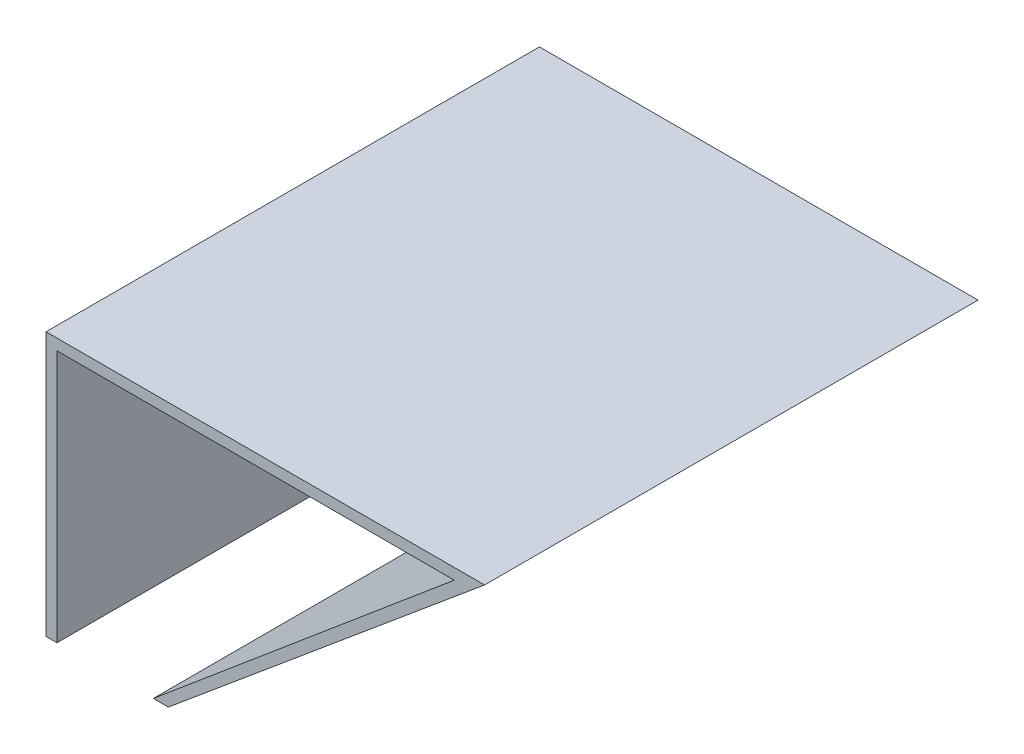
ISO-10303-21;
HEADER;
FILE_DESCRIPTION(('STEP AP214'),'2;1');
FILE_NAME('part.step','',(''),(''),'','','');
FILE_SCHEMA(('AUTOMOTIVE_DESIGN { 1 0 10303 214 1 1 1 1 }'));
ENDSEC;
DATA;
#1=APPLICATION_CONTEXT('core data for automotive mechanical design processes');
#2=APPLICATION_PROTOCOL_DEFINITION('international standard','automotive_design',2000,#1);
#3=PRODUCT_CONTEXT('',#1,'mechanical');
#4=PRODUCT('Part','Part','',(#3));
#5=PRODUCT_RELATED_PRODUCT_CATEGORY('part','',(#4));
#6=PRODUCT_DEFINITION_FORMATION('','',#4);
#7=PRODUCT_DEFINITION_CONTEXT('part definition',#1,'design');
#8=PRODUCT_DEFINITION('design','',#6,#7);
#9=PRODUCT_DEFINITION_SHAPE('','',#8);
#10=(LENGTH_UNIT() NAMED_UNIT(*) SI_UNIT(.MILLI.,.METRE.));
#11=(NAMED_UNIT(*) PLANE_ANGLE_UNIT() SI_UNIT($,.RADIAN.));
#12=(NAMED_UNIT(*) SI_UNIT($,.STERADIAN.) SOLID_ANGLE_UNIT());
#13=UNCERTAINTY_MEASURE_WITH_UNIT(LENGTH_MEASURE(1.E-05),#10,'distance_accuracy_value','');
#14=(GEOMETRIC_REPRESENTATION_CONTEXT(3) GLOBAL_UNCERTAINTY_ASSIGNED_CONTEXT((#13)) GLOBAL_UNIT_ASSIGNED_CONTEXT((#10,
#11,#12)) REPRESENTATION_CONTEXT('',''));
#15=CARTESIAN_POINT('',(0.,0.,0.));
#16=DIRECTION('',(0.,0.,1.));
#17=DIRECTION('',(1.,0.,0.));
#18=AXIS2_PLACEMENT_3D('',#15,#16,#17);
#19=CARTESIAN_POINT('',(0.,0.,45.));
#20=DIRECTION('',(0.,1.,0.));
#21=DIRECTION('',(0.,0.,1.));
#22=AXIS2_PLACEMENT_3D('',#19,#20,#21);
#23=PLANE('',#22);
#24=DIRECTION('',(1.,0.,0.));
#25=VECTOR('',#24,1.);
#26=CARTESIAN_POINT('',(0.,0.,0.));
#27=LINE('',#26,#25);
#28=CARTESIAN_POINT('',(0.,0.,0.));
#29=VERTEX_POINT('',#28);
#30=CARTESIAN_POINT('',(1.,0.,0.));
#31=VERTEX_POINT('',#30);
#32=EDGE_CURVE('E128',#29,#31,#27,.T.);
#33=ORIENTED_EDGE('',*,*,#32,.T.);
#34=DIRECTION('',(0.,0.,-1.));
#35=VECTOR('',#34,1.);
#36=CARTESIAN_POINT('',(1.,0.,45.));
#37=LINE('',#36,#35);
#38=CARTESIAN_POINT('',(1.,0.,45.));
#39=VERTEX_POINT('',#38);
#40=EDGE_CURVE('E11',#39,#31,#37,.T.);
#41=ORIENTED_EDGE('',*,*,#40,.F.);
#42=DIRECTION('',(1.,0.,0.));
#43=VECTOR('',#42,1.);
#44=CARTESIAN_POINT('',(0.,0.,45.));
#45=LINE('',#44,#43);
#46=CARTESIAN_POINT('',(0.,0.,45.));
#47=VERTEX_POINT('',#46);
#48=EDGE_CURVE('E142',#47,#39,#45,.T.);
#49=ORIENTED_EDGE('',*,*,#48,.F.);
#50=DIRECTION('',(0.,0.,-1.));
#51=VECTOR('',#50,1.);
#52=CARTESIAN_POINT('',(0.,0.,45.));
#53=LINE('',#52,#51);
#54=EDGE_CURVE('E124',#47,#29,#53,.T.);
#55=ORIENTED_EDGE('',*,*,#54,.T.);
#56=EDGE_LOOP('',(#33,#41,#49,#55));
#57=FACE_BOUND('',#56,.T.);
#58=ADVANCED_FACE('F32',(#57),#23,.F.);
#59=CARTESIAN_POINT('',(1.,23.0660171782963,45.));
#60=DIRECTION('',(-1.,0.,0.));
#61=DIRECTION('',(0.,-1.,0.));
#62=AXIS2_PLACEMENT_3D('',#59,#60,#61);
#63=PLANE('',#62);
#64=DIRECTION('',(0.,1.,0.));
#65=VECTOR('',#64,1.);
#66=CARTESIAN_POINT('',(1.,23.0660171782963,0.));
#67=LINE('',#66,#65);
#68=CARTESIAN_POINT('',(1.,23.0660171782963,0.));
#69=VERTEX_POINT('',#68);
#70=EDGE_CURVE('E131',#31,#69,#67,.T.);
#71=ORIENTED_EDGE('',*,*,#70,.T.);
#72=DIRECTION('',(0.,0.,-1.));
#73=VECTOR('',#72,1.);
#74=CARTESIAN_POINT('',(1.,23.0660171782963,45.));
#75=LINE('',#74,#73);
#76=CARTESIAN_POINT('',(1.,23.0660171782963,45.));
#77=VERTEX_POINT('',#76);
#78=EDGE_CURVE('E40',#77,#69,#75,.T.);
#79=ORIENTED_EDGE('',*,*,#78,.F.);
#80=DIRECTION('',(0.,1.,0.));
#81=VECTOR('',#80,1.);
#82=CARTESIAN_POINT('',(1.,23.0660171782963,45.));
#83=LINE('',#82,#81);
#84=EDGE_CURVE('E91',#39,#77,#83,.T.);
#85=ORIENTED_EDGE('',*,*,#84,.F.);
#86=ORIENTED_EDGE('',*,*,#40,.T.);
#87=EDGE_LOOP('',(#71,#79,#85,#86));
#88=FACE_BOUND('',#87,.T.);
#89=ADVANCED_FACE('F177',(#88),#63,.F.);
#90=CARTESIAN_POINT('',(37.2408481292946,23.0660171782963,45.));
#91=DIRECTION('',(0.,1.,0.));
#92=DIRECTION('',(-1.,0.,0.));
#93=AXIS2_PLACEMENT_3D('',#90,#91,#92);
#94=PLANE('',#93);
#95=DIRECTION('',(1.,0.,0.));
#96=VECTOR('',#95,1.);
#97=CARTESIAN_POINT('',(37.2408481292946,23.0660171782963,0.));
#98=LINE('',#97,#96);
#99=CARTESIAN_POINT('',(37.2408481292946,23.0660171782963,0.));
#100=VERTEX_POINT('',#99);
#101=EDGE_CURVE('E133',#69,#100,#98,.T.);
#102=ORIENTED_EDGE('',*,*,#101,.T.);
#103=DIRECTION('',(0.,0.,-1.));
#104=VECTOR('',#103,1.);
#105=CARTESIAN_POINT('',(37.2408481292946,23.0660171782963,45.));
#106=LINE('',#105,#104);
#107=CARTESIAN_POINT('',(37.2408481292946,23.0660171782963,45.));
#108=VERTEX_POINT('',#107);
#109=EDGE_CURVE('E149',#108,#100,#106,.T.);
#110=ORIENTED_EDGE('',*,*,#109,.F.);
#111=DIRECTION('',(1.,0.,0.));
#112=VECTOR('',#111,1.);
#113=CARTESIAN_POINT('',(37.2408481292946,23.0660171782963,45.));
#114=LINE('',#113,#112);
#115=EDGE_CURVE('E157',#77,#108,#114,.T.);
#116=ORIENTED_EDGE('',*,*,#115,.F.);
#117=ORIENTED_EDGE('',*,*,#78,.T.);
#118=EDGE_LOOP('',(#102,#110,#116,#117));
#119=FACE_BOUND('',#118,.T.);
#120=ADVANCED_FACE('F155',(#119),#94,.F.);
#121=CARTESIAN_POINT('',(9.78816503103772,0.,45.));
#122=DIRECTION('',(0.643286320722137,-0.765625698087372,0.));
#123=DIRECTION('',(0.765625698087372,0.643286320722137,0.));
#124=AXIS2_PLACEMENT_3D('',#121,#122,#123);
#125=PLANE('',#124);
#126=DIRECTION('',(-0.765625698087372,-0.643286320722137,0.));
#127=VECTOR('',#126,1.);
#128=CARTESIAN_POINT('',(9.78816503103772,0.,0.));
#129=LINE('',#128,#127);
#130=CARTESIAN_POINT('',(9.78816503103772,0.,0.));
#131=VERTEX_POINT('',#130);
#132=EDGE_CURVE('E135',#100,#131,#129,.T.);
#133=ORIENTED_EDGE('',*,*,#132,.T.);
#134=DIRECTION('',(0.,0.,-1.));
#135=VECTOR('',#134,1.);
#136=CARTESIAN_POINT('',(9.78816503103772,0.,45.));
#137=LINE('',#136,#135);
#138=CARTESIAN_POINT('',(9.78816503103772,0.,45.));
#139=VERTEX_POINT('',#138);
#140=EDGE_CURVE('E146',#139,#131,#137,.T.);
#141=ORIENTED_EDGE('',*,*,#140,.F.);
#142=DIRECTION('',(-0.765625698087372,-0.643286320722137,0.));
#143=VECTOR('',#142,1.);
#144=CARTESIAN_POINT('',(9.78816503103772,0.,45.));
#145=LINE('',#144,#143);
#146=EDGE_CURVE('E169',#108,#139,#145,.T.);
#147=ORIENTED_EDGE('',*,*,#146,.F.);
#148=ORIENTED_EDGE('',*,*,#109,.T.);
#149=EDGE_LOOP('',(#133,#141,#147,#148));
#150=FACE_BOUND('',#149,.T.);
#151=ADVANCED_FACE('F165',(#150),#125,.F.);
#152=CARTESIAN_POINT('',(9.78816503103772,0.,45.));
#153=DIRECTION('',(0.,1.,0.));
#154=DIRECTION('',(0.,0.,1.));
#155=AXIS2_PLACEMENT_3D('',#152,#153,#154);
#156=PLANE('',#155);
#157=DIRECTION('',(1.,0.,0.));
#158=VECTOR('',#157,1.);
#159=CARTESIAN_POINT('',(9.78816503103772,0.,0.));
#160=LINE('',#159,#158);
#161=CARTESIAN_POINT('',(11.1602277061651,0.,0.));
#162=VERTEX_POINT('',#161);
#163=EDGE_CURVE('E137',#131,#162,#160,.T.);
#164=ORIENTED_EDGE('',*,*,#163,.T.);
#165=DIRECTION('',(0.,0.,-1.));
#166=VECTOR('',#165,1.);
#167=CARTESIAN_POINT('',(11.1602277061651,0.,45.));
#168=LINE('',#167,#166);
#169=CARTESIAN_POINT('',(11.1602277061651,0.,45.));
#170=VERTEX_POINT('',#169);
#171=EDGE_CURVE('E119',#170,#162,#168,.T.);
#172=ORIENTED_EDGE('',*,*,#171,.F.);
#173=DIRECTION('',(1.,0.,0.));
#174=VECTOR('',#173,1.);
#175=CARTESIAN_POINT('',(9.78816503103772,0.,45.));
#176=LINE('',#175,#174);
#177=EDGE_CURVE('E110',#139,#170,#176,.T.);
#178=ORIENTED_EDGE('',*,*,#177,.F.);
#179=ORIENTED_EDGE('',*,*,#140,.T.);
#180=EDGE_LOOP('',(#164,#172,#178,#179));
#181=FACE_BOUND('',#180,.T.);
#182=ADVANCED_FACE('F168',(#181),#156,.F.);
#183=CARTESIAN_POINT('',(11.1602277061651,0.,45.));
#184=DIRECTION('',(-0.640700755711725,0.767790688684373,0.));
#185=DIRECTION('',(-0.767790688684374,-0.640700755711725,0.));
#186=AXIS2_PLACEMENT_3D('',#183,#184,#185);
#187=PLANE('',#186);
#188=DIRECTION('',(0.767790688684373,0.640700755711725,0.));
#189=VECTOR('',#188,1.);
#190=CARTESIAN_POINT('',(11.1602277061651,0.,0.));
#191=LINE('',#190,#189);
#192=CARTESIAN_POINT('',(40.,24.0660171782963,0.));
#193=VERTEX_POINT('',#192);
#194=EDGE_CURVE('E118',#162,#193,#191,.T.);
#195=ORIENTED_EDGE('',*,*,#194,.T.);
#196=DIRECTION('',(0.,0.,-1.));
#197=VECTOR('',#196,1.);
#198=CARTESIAN_POINT('',(40.,24.0660171782963,45.));
#199=LINE('',#198,#197);
#200=CARTESIAN_POINT('',(40.,24.0660171782963,45.));
#201=VERTEX_POINT('',#200);
#202=EDGE_CURVE('E115',#201,#193,#199,.T.);
#203=ORIENTED_EDGE('',*,*,#202,.F.);
#204=DIRECTION('',(0.767790688684373,0.640700755711725,0.));
#205=VECTOR('',#204,1.);
#206=CARTESIAN_POINT('',(11.1602277061651,0.,45.));
#207=LINE('',#206,#205);
#208=EDGE_CURVE('E104',#170,#201,#207,.T.);
#209=ORIENTED_EDGE('',*,*,#208,.F.);
#210=ORIENTED_EDGE('',*,*,#171,.T.);
#211=EDGE_LOOP('',(#195,#203,#209,#210));
#212=FACE_BOUND('',#211,.T.);
#213=ADVANCED_FACE('F116',(#212),#187,.F.);
#214=CARTESIAN_POINT('',(40.,24.0660171782963,45.));
#215=DIRECTION('',(0.,-1.,0.));
#216=DIRECTION('',(0.,0.,-1.));
#217=AXIS2_PLACEMENT_3D('',#214,#215,#216);
#218=PLANE('',#217);
#219=DIRECTION('',(-1.,0.,0.));
#220=VECTOR('',#219,1.);
#221=CARTESIAN_POINT('',(40.,24.0660171782963,0.));
#222=LINE('',#221,#220);
#223=CARTESIAN_POINT('',(0.,24.0660171782963,0.));
#224=VERTEX_POINT('',#223);
#225=EDGE_CURVE('E77',#193,#224,#222,.T.);
#226=ORIENTED_EDGE('',*,*,#225,.T.);
#227=DIRECTION('',(0.,0.,-1.));
#228=VECTOR('',#227,1.);
#229=CARTESIAN_POINT('',(0.,24.0660171782963,45.));
#230=LINE('',#229,#228);
#231=CARTESIAN_POINT('',(0.,24.0660171782963,45.));
#232=VERTEX_POINT('',#231);
#233=EDGE_CURVE('E120',#232,#224,#230,.T.);
#234=ORIENTED_EDGE('',*,*,#233,.F.);
#235=DIRECTION('',(-1.,0.,0.));
#236=VECTOR('',#235,1.);
#237=CARTESIAN_POINT('',(40.,24.0660171782963,45.));
#238=LINE('',#237,#236);
#239=EDGE_CURVE('E108',#201,#232,#238,.T.);
#240=ORIENTED_EDGE('',*,*,#239,.F.);
#241=ORIENTED_EDGE('',*,*,#202,.T.);
#242=EDGE_LOOP('',(#226,#234,#240,#241));
#243=FACE_BOUND('',#242,.T.);
#244=ADVANCED_FACE('F122',(#243),#218,.F.);
#245=CARTESIAN_POINT('',(0.,24.0660171782963,45.));
#246=DIRECTION('',(1.,0.,0.));
#247=DIRECTION('',(0.,0.,-1.));
#248=AXIS2_PLACEMENT_3D('',#245,#246,#247);
#249=PLANE('',#248);
#250=DIRECTION('',(0.,-1.,0.));
#251=VECTOR('',#250,1.);
#252=CARTESIAN_POINT('',(0.,24.0660171782963,0.));
#253=LINE('',#252,#251);
#254=EDGE_CURVE('E83',#224,#29,#253,.T.);
#255=ORIENTED_EDGE('',*,*,#254,.T.);
#256=ORIENTED_EDGE('',*,*,#54,.F.);
#257=DIRECTION('',(0.,-1.,0.));
#258=VECTOR('',#257,1.);
#259=CARTESIAN_POINT('',(0.,24.0660171782963,45.));
#260=LINE('',#259,#258);
#261=EDGE_CURVE('E48',#232,#47,#260,.T.);
#262=ORIENTED_EDGE('',*,*,#261,.F.);
#263=ORIENTED_EDGE('',*,*,#233,.T.);
#264=EDGE_LOOP('',(#255,#256,#262,#263));
#265=FACE_BOUND('',#264,.T.);
#266=ADVANCED_FACE('F193',(#265),#249,.F.);
#267=CARTESIAN_POINT('',(0.,0.,45.));
#268=DIRECTION('',(0.,0.,-1.));
#269=DIRECTION('',(-1.,0.,0.));
#270=AXIS2_PLACEMENT_3D('',#267,#268,#269);
#271=PLANE('',#270);
#272=ORIENTED_EDGE('',*,*,#48,.T.);
#273=ORIENTED_EDGE('',*,*,#84,.T.);
#274=ORIENTED_EDGE('',*,*,#115,.T.);
#275=ORIENTED_EDGE('',*,*,#146,.T.);
#276=ORIENTED_EDGE('',*,*,#177,.T.);
#277=ORIENTED_EDGE('',*,*,#208,.T.);
#278=ORIENTED_EDGE('',*,*,#239,.T.);
#279=ORIENTED_EDGE('',*,*,#261,.T.);
#280=EDGE_LOOP('',(#272,#273,#274,#275,#276,#277,#278,#279));
#281=FACE_BOUND('',#280,.T.);
#282=ADVANCED_FACE('F106',(#281),#271,.F.);
#283=CARTESIAN_POINT('',(0.,0.,0.));
#284=DIRECTION('',(0.,0.,-1.));
#285=DIRECTION('',(-1.,0.,0.));
#286=AXIS2_PLACEMENT_3D('',#283,#284,#285);
#287=PLANE('',#286);
#288=ORIENTED_EDGE('',*,*,#32,.F.);
#289=ORIENTED_EDGE('',*,*,#254,.F.);
#290=ORIENTED_EDGE('',*,*,#225,.F.);
#291=ORIENTED_EDGE('',*,*,#194,.F.);
#292=ORIENTED_EDGE('',*,*,#163,.F.);
#293=ORIENTED_EDGE('',*,*,#132,.F.);
#294=ORIENTED_EDGE('',*,*,#101,.F.);
#295=ORIENTED_EDGE('',*,*,#70,.F.);
#296=EDGE_LOOP('',(#288,#289,#290,#291,#292,#293,#294,#295));
#297=FACE_BOUND('',#296,.T.);
#298=ADVANCED_FACE('F161',(#297),#287,.T.);
#299=CLOSED_SHELL('',(#58,#89,#120,#151,#182,#213,#244,#266,#282,#298));
#300=MANIFOLD_SOLID_BREP('B2',#299);
#301=ADVANCED_BREP_SHAPE_REPRESENTATION('',(#18,#300),#14);
#302=SHAPE_DEFINITION_REPRESENTATION(#9,#301);
ENDSEC;
END-ISO-10303-21;
